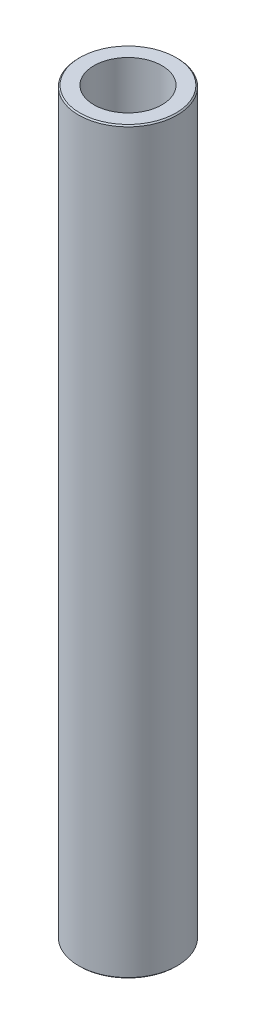
ISO-10303-21;
HEADER;
FILE_DESCRIPTION(('STEP AP214'),'2;1');
FILE_NAME('part.step','',(''),(''),'','','');
FILE_SCHEMA(('AUTOMOTIVE_DESIGN { 1 0 10303 214 1 1 1 1 }'));
ENDSEC;
DATA;
#1=APPLICATION_CONTEXT('core data for automotive mechanical design processes');
#2=APPLICATION_PROTOCOL_DEFINITION('international standard','automotive_design',2000,#1);
#3=PRODUCT_CONTEXT('',#1,'mechanical');
#4=PRODUCT('Part','Part','',(#3));
#5=PRODUCT_RELATED_PRODUCT_CATEGORY('part','',(#4));
#6=PRODUCT_DEFINITION_FORMATION('','',#4);
#7=PRODUCT_DEFINITION_CONTEXT('part definition',#1,'design');
#8=PRODUCT_DEFINITION('design','',#6,#7);
#9=PRODUCT_DEFINITION_SHAPE('','',#8);
#10=(LENGTH_UNIT() NAMED_UNIT(*) SI_UNIT(.MILLI.,.METRE.));
#11=(NAMED_UNIT(*) PLANE_ANGLE_UNIT() SI_UNIT($,.RADIAN.));
#12=(NAMED_UNIT(*) SI_UNIT($,.STERADIAN.) SOLID_ANGLE_UNIT());
#13=UNCERTAINTY_MEASURE_WITH_UNIT(LENGTH_MEASURE(1.E-05),#10,'distance_accuracy_value','');
#14=(GEOMETRIC_REPRESENTATION_CONTEXT(3) GLOBAL_UNCERTAINTY_ASSIGNED_CONTEXT((#13)) GLOBAL_UNIT_ASSIGNED_CONTEXT((#10,
#11,#12)) REPRESENTATION_CONTEXT('',''));
#15=CARTESIAN_POINT('',(0.,0.,0.));
#16=DIRECTION('',(0.,0.,1.));
#17=DIRECTION('',(1.,0.,0.));
#18=AXIS2_PLACEMENT_3D('',#15,#16,#17);
#19=CARTESIAN_POINT('',(0.,600.,0.));
#20=DIRECTION('',(0.,-1.,0.));
#21=DIRECTION('',(0.,0.,-1.));
#22=AXIS2_PLACEMENT_3D('',#19,#20,#21);
#23=CYLINDRICAL_SURFACE('',#22,40.);
#24=CARTESIAN_POINT('',(0.,599.005823168489,0.));
#25=DIRECTION('',(0.,1.,0.));
#26=DIRECTION('',(0.,0.,1.));
#27=AXIS2_PLACEMENT_3D('',#24,#25,#26);
#28=CIRCLE('',#27,40.);
#29=CARTESIAN_POINT('',(0.,599.005823168489,40.));
#30=VERTEX_POINT('',#29);
#31=EDGE_CURVE('E50',#30,#30,#28,.F.);
#32=ORIENTED_EDGE('',*,*,#31,.T.);
#33=EDGE_LOOP('',(#32));
#34=FACE_BOUND('',#33,.T.);
#35=CARTESIAN_POINT('',(0.,0.994176831511262,0.));
#36=DIRECTION('',(0.,1.,0.));
#37=DIRECTION('',(0.,0.,1.));
#38=AXIS2_PLACEMENT_3D('',#35,#36,#37);
#39=CIRCLE('',#38,40.);
#40=CARTESIAN_POINT('',(0.,0.994176831511262,40.));
#41=VERTEX_POINT('',#40);
#42=EDGE_CURVE('E51',#41,#41,#39,.T.);
#43=ORIENTED_EDGE('',*,*,#42,.T.);
#44=EDGE_LOOP('',(#43));
#45=FACE_BOUND('',#44,.T.);
#46=ADVANCED_FACE('F39',(#34,#45),#23,.T.);
#47=CARTESIAN_POINT('',(0.,600.,0.));
#48=DIRECTION('',(0.,1.,0.));
#49=DIRECTION('',(0.,0.,1.));
#50=AXIS2_PLACEMENT_3D('',#47,#48,#49);
#51=PLANE('',#50);
#52=CARTESIAN_POINT('',(0.,600.,0.));
#53=DIRECTION('',(0.,1.,0.));
#54=DIRECTION('',(0.,0.,1.));
#55=AXIS2_PLACEMENT_3D('',#52,#53,#54);
#56=CIRCLE('',#55,39.0058231684886);
#57=CARTESIAN_POINT('',(0.,600.,39.0058231684886));
#58=VERTEX_POINT('',#57);
#59=EDGE_CURVE('E54',#58,#58,#56,.T.);
#60=ORIENTED_EDGE('',*,*,#59,.T.);
#61=EDGE_LOOP('',(#60));
#62=FACE_BOUND('',#61,.T.);
#63=CARTESIAN_POINT('',(0.,600.,0.));
#64=DIRECTION('',(0.,1.,0.));
#65=DIRECTION('',(0.,0.,1.));
#66=AXIS2_PLACEMENT_3D('',#63,#64,#65);
#67=CIRCLE('',#66,27.5936317544318);
#68=CARTESIAN_POINT('',(0.,600.,27.5936317544318));
#69=VERTEX_POINT('',#68);
#70=EDGE_CURVE('E58',#69,#69,#67,.T.);
#71=ORIENTED_EDGE('',*,*,#70,.F.);
#72=EDGE_LOOP('',(#71));
#73=FACE_BOUND('',#72,.T.);
#74=ADVANCED_FACE('F69',(#62,#73),#51,.T.);
#75=CARTESIAN_POINT('',(0.,0.,0.));
#76=DIRECTION('',(0.,1.,0.));
#77=DIRECTION('',(0.,0.,1.));
#78=AXIS2_PLACEMENT_3D('',#75,#76,#77);
#79=PLANE('',#78);
#80=CARTESIAN_POINT('',(0.,0.,0.));
#81=DIRECTION('',(0.,1.,0.));
#82=DIRECTION('',(0.,0.,1.));
#83=AXIS2_PLACEMENT_3D('',#80,#81,#82);
#84=CIRCLE('',#83,39.0058231684888);
#85=CARTESIAN_POINT('',(0.,0.,39.0058231684888));
#86=VERTEX_POINT('',#85);
#87=EDGE_CURVE('E10',#86,#86,#84,.F.);
#88=ORIENTED_EDGE('',*,*,#87,.T.);
#89=EDGE_LOOP('',(#88));
#90=FACE_BOUND('',#89,.T.);
#91=CARTESIAN_POINT('',(0.,0.,0.));
#92=DIRECTION('',(0.,1.,0.));
#93=DIRECTION('',(0.,0.,1.));
#94=AXIS2_PLACEMENT_3D('',#91,#92,#93);
#95=CIRCLE('',#94,27.5936317544318);
#96=CARTESIAN_POINT('',(0.,0.,27.5936317544318));
#97=VERTEX_POINT('',#96);
#98=EDGE_CURVE('E63',#97,#97,#95,.T.);
#99=ORIENTED_EDGE('',*,*,#98,.T.);
#100=EDGE_LOOP('',(#99));
#101=FACE_BOUND('',#100,.T.);
#102=ADVANCED_FACE('F75',(#90,#101),#79,.F.);
#103=CARTESIAN_POINT('',(0.,600.,0.));
#104=DIRECTION('',(0.,-1.,0.));
#105=DIRECTION('',(0.,0.,-1.));
#106=AXIS2_PLACEMENT_3D('',#103,#104,#105);
#107=CYLINDRICAL_SURFACE('',#106,27.5936317544318);
#108=ORIENTED_EDGE('',*,*,#70,.T.);
#109=EDGE_LOOP('',(#108));
#110=FACE_BOUND('',#109,.T.);
#111=ORIENTED_EDGE('',*,*,#98,.F.);
#112=EDGE_LOOP('',(#111));
#113=FACE_BOUND('',#112,.T.);
#114=ADVANCED_FACE('F70',(#110,#113),#107,.F.);
#115=CARTESIAN_POINT('',(0.,600.,0.));
#116=DIRECTION('',(0.,-1.,0.));
#117=DIRECTION('',(0.,0.,-1.));
#118=AXIS2_PLACEMENT_3D('',#115,#116,#117);
#119=CONICAL_SURFACE('',#118,39.0058231684886,0.785398163397459);
#120=ORIENTED_EDGE('',*,*,#31,.F.);
#121=EDGE_LOOP('',(#120));
#122=FACE_BOUND('',#121,.T.);
#123=ORIENTED_EDGE('',*,*,#59,.F.);
#124=EDGE_LOOP('',(#123));
#125=FACE_BOUND('',#124,.T.);
#126=ADVANCED_FACE('F81',(#122,#125),#119,.T.);
#127=CARTESIAN_POINT('',(0.,0.994176831511262,0.));
#128=DIRECTION('',(0.,1.,0.));
#129=DIRECTION('',(0.,0.,1.));
#130=AXIS2_PLACEMENT_3D('',#127,#128,#129);
#131=CONICAL_SURFACE('',#130,40.,0.785398163397431);
#132=ORIENTED_EDGE('',*,*,#87,.F.);
#133=EDGE_LOOP('',(#132));
#134=FACE_BOUND('',#133,.T.);
#135=ORIENTED_EDGE('',*,*,#42,.F.);
#136=EDGE_LOOP('',(#135));
#137=FACE_BOUND('',#136,.T.);
#138=ADVANCED_FACE('F45',(#134,#137),#131,.T.);
#139=CLOSED_SHELL('',(#46,#74,#102,#114,#126,#138));
#140=MANIFOLD_SOLID_BREP('B2',#139);
#141=ADVANCED_BREP_SHAPE_REPRESENTATION('',(#18,#140),#14);
#142=SHAPE_DEFINITION_REPRESENTATION(#9,#141);
ENDSEC;
END-ISO-10303-21;
